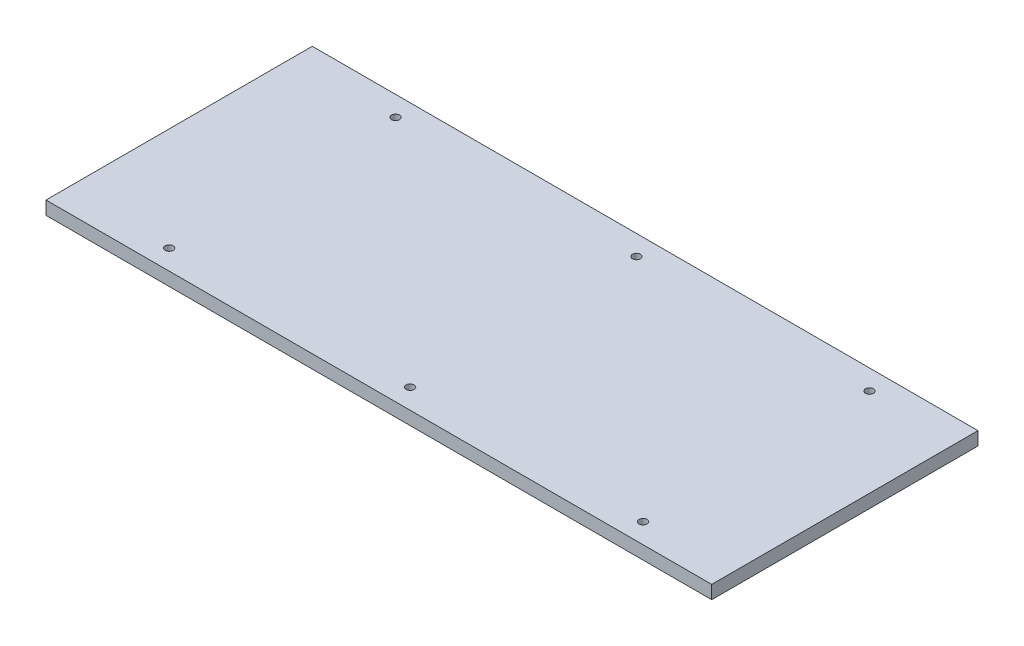
ISO-10303-21;
HEADER;
FILE_DESCRIPTION(('STEP AP214'),'2;1');
FILE_NAME('part.step','',(''),(''),'','','');
FILE_SCHEMA(('AUTOMOTIVE_DESIGN { 1 0 10303 214 1 1 1 1 }'));
ENDSEC;
DATA;
#1=APPLICATION_CONTEXT('core data for automotive mechanical design processes');
#2=APPLICATION_PROTOCOL_DEFINITION('international standard','automotive_design',2000,#1);
#3=PRODUCT_CONTEXT('',#1,'mechanical');
#4=PRODUCT('Part','Part','',(#3));
#5=PRODUCT_RELATED_PRODUCT_CATEGORY('part','',(#4));
#6=PRODUCT_DEFINITION_FORMATION('','',#4);
#7=PRODUCT_DEFINITION_CONTEXT('part definition',#1,'design');
#8=PRODUCT_DEFINITION('design','',#6,#7);
#9=PRODUCT_DEFINITION_SHAPE('','',#8);
#10=(LENGTH_UNIT() NAMED_UNIT(*) SI_UNIT(.MILLI.,.METRE.));
#11=(NAMED_UNIT(*) PLANE_ANGLE_UNIT() SI_UNIT($,.RADIAN.));
#12=(NAMED_UNIT(*) SI_UNIT($,.STERADIAN.) SOLID_ANGLE_UNIT());
#13=UNCERTAINTY_MEASURE_WITH_UNIT(LENGTH_MEASURE(1.E-05),#10,'distance_accuracy_value','');
#14=(GEOMETRIC_REPRESENTATION_CONTEXT(3) GLOBAL_UNCERTAINTY_ASSIGNED_CONTEXT((#13)) GLOBAL_UNIT_ASSIGNED_CONTEXT((#10,
#11,#12)) REPRESENTATION_CONTEXT('',''));
#15=CARTESIAN_POINT('',(0.,0.,0.));
#16=DIRECTION('',(0.,0.,1.));
#17=DIRECTION('',(1.,0.,0.));
#18=AXIS2_PLACEMENT_3D('',#15,#16,#17);
#19=CARTESIAN_POINT('',(0.,10.,0.));
#20=DIRECTION('',(0.,1.,0.));
#21=DIRECTION('',(0.,0.,1.));
#22=AXIS2_PLACEMENT_3D('',#19,#20,#21);
#23=PLANE('',#22);
#24=CARTESIAN_POINT('',(183.493329941735,10.,85.));
#25=DIRECTION('',(0.,1.,0.));
#26=DIRECTION('',(0.,0.,1.));
#27=AXIS2_PLACEMENT_3D('',#24,#25,#26);
#28=CIRCLE('',#27,2.99999999999999);
#29=CARTESIAN_POINT('',(183.493329941735,10.,88.));
#30=VERTEX_POINT('',#29);
#31=EDGE_CURVE('E158',#30,#30,#28,.T.);
#32=ORIENTED_EDGE('',*,*,#31,.F.);
#33=EDGE_LOOP('',(#32));
#34=FACE_BOUND('',#33,.T.);
#35=CARTESIAN_POINT('',(-172.506670058265,10.,-85.));
#36=DIRECTION('',(0.,1.,0.));
#37=DIRECTION('',(0.,0.,1.));
#38=AXIS2_PLACEMENT_3D('',#35,#36,#37);
#39=CIRCLE('',#38,2.99999999999999);
#40=CARTESIAN_POINT('',(-172.506670058265,10.,-82.));
#41=VERTEX_POINT('',#40);
#42=EDGE_CURVE('E142',#41,#41,#39,.T.);
#43=ORIENTED_EDGE('',*,*,#42,.F.);
#44=EDGE_LOOP('',(#43));
#45=FACE_BOUND('',#44,.T.);
#46=CARTESIAN_POINT('',(8.49332994173532,10.,-85.));
#47=DIRECTION('',(0.,1.,0.));
#48=DIRECTION('',(0.,0.,1.));
#49=AXIS2_PLACEMENT_3D('',#46,#47,#48);
#50=CIRCLE('',#49,3.);
#51=CARTESIAN_POINT('',(8.49332994173532,10.,-82.));
#52=VERTEX_POINT('',#51);
#53=EDGE_CURVE('E112',#52,#52,#50,.T.);
#54=ORIENTED_EDGE('',*,*,#53,.F.);
#55=EDGE_LOOP('',(#54));
#56=FACE_BOUND('',#55,.T.);
#57=DIRECTION('',(0.,0.,1.));
#58=VECTOR('',#57,1.);
#59=CARTESIAN_POINT('',(-250.,10.,100.));
#60=LINE('',#59,#58);
#61=CARTESIAN_POINT('',(-250.,10.,-100.));
#62=VERTEX_POINT('',#61);
#63=CARTESIAN_POINT('',(-250.,10.,100.));
#64=VERTEX_POINT('',#63);
#65=EDGE_CURVE('E92',#62,#64,#60,.T.);
#66=ORIENTED_EDGE('',*,*,#65,.T.);
#67=DIRECTION('',(1.,0.,0.));
#68=VECTOR('',#67,1.);
#69=CARTESIAN_POINT('',(250.,10.,100.));
#70=LINE('',#69,#68);
#71=CARTESIAN_POINT('',(250.,10.,100.));
#72=VERTEX_POINT('',#71);
#73=EDGE_CURVE('E87',#64,#72,#70,.T.);
#74=ORIENTED_EDGE('',*,*,#73,.T.);
#75=DIRECTION('',(0.,0.,-1.));
#76=VECTOR('',#75,1.);
#77=CARTESIAN_POINT('',(250.,10.,100.));
#78=LINE('',#77,#76);
#79=CARTESIAN_POINT('',(250.,10.,-100.));
#80=VERTEX_POINT('',#79);
#81=EDGE_CURVE('E90',#72,#80,#78,.T.);
#82=ORIENTED_EDGE('',*,*,#81,.T.);
#83=DIRECTION('',(-1.,0.,0.));
#84=VECTOR('',#83,1.);
#85=CARTESIAN_POINT('',(250.,10.,-100.));
#86=LINE('',#85,#84);
#87=EDGE_CURVE('E57',#80,#62,#86,.T.);
#88=ORIENTED_EDGE('',*,*,#87,.T.);
#89=EDGE_LOOP('',(#66,#74,#82,#88));
#90=FACE_BOUND('',#89,.T.);
#91=CARTESIAN_POINT('',(8.49332994173534,10.,85.));
#92=DIRECTION('',(0.,1.,0.));
#93=DIRECTION('',(0.,0.,1.));
#94=AXIS2_PLACEMENT_3D('',#91,#92,#93);
#95=CIRCLE('',#94,3.);
#96=CARTESIAN_POINT('',(8.49332994173534,10.,88.));
#97=VERTEX_POINT('',#96);
#98=EDGE_CURVE('E134',#97,#97,#95,.T.);
#99=ORIENTED_EDGE('',*,*,#98,.F.);
#100=EDGE_LOOP('',(#99));
#101=FACE_BOUND('',#100,.T.);
#102=CARTESIAN_POINT('',(-172.506670058265,10.,85.));
#103=DIRECTION('',(0.,1.,0.));
#104=DIRECTION('',(0.,0.,1.));
#105=AXIS2_PLACEMENT_3D('',#102,#103,#104);
#106=CIRCLE('',#105,2.99999999999999);
#107=CARTESIAN_POINT('',(-172.506670058265,10.,88.));
#108=VERTEX_POINT('',#107);
#109=EDGE_CURVE('E150',#108,#108,#106,.T.);
#110=ORIENTED_EDGE('',*,*,#109,.F.);
#111=EDGE_LOOP('',(#110));
#112=FACE_BOUND('',#111,.T.);
#113=CARTESIAN_POINT('',(183.493329941735,10.,-85.));
#114=DIRECTION('',(0.,1.,0.));
#115=DIRECTION('',(0.,0.,1.));
#116=AXIS2_PLACEMENT_3D('',#113,#114,#115);
#117=CIRCLE('',#116,2.99999999999999);
#118=CARTESIAN_POINT('',(183.493329941735,10.,-82.));
#119=VERTEX_POINT('',#118);
#120=EDGE_CURVE('E166',#119,#119,#117,.T.);
#121=ORIENTED_EDGE('',*,*,#120,.F.);
#122=EDGE_LOOP('',(#121));
#123=FACE_BOUND('',#122,.T.);
#124=ADVANCED_FACE('F39',(#34,#45,#56,#90,#101,#112,#123),#23,.T.);
#125=CARTESIAN_POINT('',(0.,0.,0.));
#126=DIRECTION('',(0.,1.,0.));
#127=DIRECTION('',(0.,0.,1.));
#128=AXIS2_PLACEMENT_3D('',#125,#126,#127);
#129=PLANE('',#128);
#130=DIRECTION('',(0.,0.,1.));
#131=VECTOR('',#130,1.);
#132=CARTESIAN_POINT('',(-250.,0.,100.));
#133=LINE('',#132,#131);
#134=CARTESIAN_POINT('',(-250.,0.,-100.));
#135=VERTEX_POINT('',#134);
#136=CARTESIAN_POINT('',(-250.,0.,100.));
#137=VERTEX_POINT('',#136);
#138=EDGE_CURVE('E108',#135,#137,#133,.T.);
#139=ORIENTED_EDGE('',*,*,#138,.F.);
#140=DIRECTION('',(-1.,0.,0.));
#141=VECTOR('',#140,1.);
#142=CARTESIAN_POINT('',(250.,0.,-100.));
#143=LINE('',#142,#141);
#144=CARTESIAN_POINT('',(250.,0.,-100.));
#145=VERTEX_POINT('',#144);
#146=EDGE_CURVE('E80',#145,#135,#143,.T.);
#147=ORIENTED_EDGE('',*,*,#146,.F.);
#148=DIRECTION('',(0.,0.,-1.));
#149=VECTOR('',#148,1.);
#150=CARTESIAN_POINT('',(250.,0.,100.));
#151=LINE('',#150,#149);
#152=CARTESIAN_POINT('',(250.,0.,100.));
#153=VERTEX_POINT('',#152);
#154=EDGE_CURVE('E74',#153,#145,#151,.T.);
#155=ORIENTED_EDGE('',*,*,#154,.F.);
#156=DIRECTION('',(1.,0.,0.));
#157=VECTOR('',#156,1.);
#158=CARTESIAN_POINT('',(250.,0.,100.));
#159=LINE('',#158,#157);
#160=EDGE_CURVE('E97',#137,#153,#159,.T.);
#161=ORIENTED_EDGE('',*,*,#160,.F.);
#162=EDGE_LOOP('',(#139,#147,#155,#161));
#163=FACE_BOUND('',#162,.T.);
#164=CARTESIAN_POINT('',(8.49332994173532,0.,-85.));
#165=DIRECTION('',(0.,1.,0.));
#166=DIRECTION('',(0.,0.,1.));
#167=AXIS2_PLACEMENT_3D('',#164,#165,#166);
#168=CIRCLE('',#167,3.);
#169=CARTESIAN_POINT('',(8.49332994173532,0.,-82.));
#170=VERTEX_POINT('',#169);
#171=EDGE_CURVE('E130',#170,#170,#168,.T.);
#172=ORIENTED_EDGE('',*,*,#171,.T.);
#173=EDGE_LOOP('',(#172));
#174=FACE_BOUND('',#173,.T.);
#175=CARTESIAN_POINT('',(8.49332994173534,0.,85.));
#176=DIRECTION('',(0.,1.,0.));
#177=DIRECTION('',(0.,0.,1.));
#178=AXIS2_PLACEMENT_3D('',#175,#176,#177);
#179=CIRCLE('',#178,3.);
#180=CARTESIAN_POINT('',(8.49332994173534,0.,88.));
#181=VERTEX_POINT('',#180);
#182=EDGE_CURVE('E138',#181,#181,#179,.T.);
#183=ORIENTED_EDGE('',*,*,#182,.T.);
#184=EDGE_LOOP('',(#183));
#185=FACE_BOUND('',#184,.T.);
#186=CARTESIAN_POINT('',(-172.506670058265,0.,-85.));
#187=DIRECTION('',(0.,1.,0.));
#188=DIRECTION('',(0.,0.,1.));
#189=AXIS2_PLACEMENT_3D('',#186,#187,#188);
#190=CIRCLE('',#189,2.99999999999999);
#191=CARTESIAN_POINT('',(-172.506670058265,0.,-82.));
#192=VERTEX_POINT('',#191);
#193=EDGE_CURVE('E146',#192,#192,#190,.T.);
#194=ORIENTED_EDGE('',*,*,#193,.T.);
#195=EDGE_LOOP('',(#194));
#196=FACE_BOUND('',#195,.T.);
#197=CARTESIAN_POINT('',(-172.506670058265,0.,85.));
#198=DIRECTION('',(0.,1.,0.));
#199=DIRECTION('',(0.,0.,1.));
#200=AXIS2_PLACEMENT_3D('',#197,#198,#199);
#201=CIRCLE('',#200,2.99999999999999);
#202=CARTESIAN_POINT('',(-172.506670058265,0.,88.));
#203=VERTEX_POINT('',#202);
#204=EDGE_CURVE('E154',#203,#203,#201,.T.);
#205=ORIENTED_EDGE('',*,*,#204,.T.);
#206=EDGE_LOOP('',(#205));
#207=FACE_BOUND('',#206,.T.);
#208=CARTESIAN_POINT('',(183.493329941735,0.,85.));
#209=DIRECTION('',(0.,1.,0.));
#210=DIRECTION('',(0.,0.,1.));
#211=AXIS2_PLACEMENT_3D('',#208,#209,#210);
#212=CIRCLE('',#211,2.99999999999999);
#213=CARTESIAN_POINT('',(183.493329941735,0.,88.));
#214=VERTEX_POINT('',#213);
#215=EDGE_CURVE('E162',#214,#214,#212,.T.);
#216=ORIENTED_EDGE('',*,*,#215,.T.);
#217=EDGE_LOOP('',(#216));
#218=FACE_BOUND('',#217,.T.);
#219=CARTESIAN_POINT('',(183.493329941735,0.,-85.));
#220=DIRECTION('',(0.,1.,0.));
#221=DIRECTION('',(0.,0.,1.));
#222=AXIS2_PLACEMENT_3D('',#219,#220,#221);
#223=CIRCLE('',#222,2.99999999999999);
#224=CARTESIAN_POINT('',(183.493329941735,0.,-82.));
#225=VERTEX_POINT('',#224);
#226=EDGE_CURVE('E170',#225,#225,#223,.T.);
#227=ORIENTED_EDGE('',*,*,#226,.T.);
#228=EDGE_LOOP('',(#227));
#229=FACE_BOUND('',#228,.T.);
#230=ADVANCED_FACE('F125',(#163,#174,#185,#196,#207,#218,#229),#129,.F.);
#231=CARTESIAN_POINT('',(-250.,10.,100.));
#232=DIRECTION('',(1.,0.,0.));
#233=DIRECTION('',(0.,0.,-1.));
#234=AXIS2_PLACEMENT_3D('',#231,#232,#233);
#235=PLANE('',#234);
#236=ORIENTED_EDGE('',*,*,#138,.T.);
#237=DIRECTION('',(0.,-1.,0.));
#238=VECTOR('',#237,1.);
#239=CARTESIAN_POINT('',(-250.,10.,100.));
#240=LINE('',#239,#238);
#241=EDGE_CURVE('E11',#64,#137,#240,.T.);
#242=ORIENTED_EDGE('',*,*,#241,.F.);
#243=ORIENTED_EDGE('',*,*,#65,.F.);
#244=DIRECTION('',(0.,-1.,0.));
#245=VECTOR('',#244,1.);
#246=CARTESIAN_POINT('',(-250.,10.,-100.));
#247=LINE('',#246,#245);
#248=EDGE_CURVE('E104',#62,#135,#247,.T.);
#249=ORIENTED_EDGE('',*,*,#248,.T.);
#250=EDGE_LOOP('',(#236,#242,#243,#249));
#251=FACE_BOUND('',#250,.T.);
#252=ADVANCED_FACE('F41',(#251),#235,.F.);
#253=CARTESIAN_POINT('',(250.,10.,100.));
#254=DIRECTION('',(0.,0.,-1.));
#255=DIRECTION('',(-1.,0.,0.));
#256=AXIS2_PLACEMENT_3D('',#253,#254,#255);
#257=PLANE('',#256);
#258=ORIENTED_EDGE('',*,*,#160,.T.);
#259=DIRECTION('',(0.,-1.,0.));
#260=VECTOR('',#259,1.);
#261=CARTESIAN_POINT('',(250.,10.,100.));
#262=LINE('',#261,#260);
#263=EDGE_CURVE('E49',#72,#153,#262,.T.);
#264=ORIENTED_EDGE('',*,*,#263,.F.);
#265=ORIENTED_EDGE('',*,*,#73,.F.);
#266=ORIENTED_EDGE('',*,*,#241,.T.);
#267=EDGE_LOOP('',(#258,#264,#265,#266));
#268=FACE_BOUND('',#267,.T.);
#269=ADVANCED_FACE('F96',(#268),#257,.F.);
#270=CARTESIAN_POINT('',(250.,10.,100.));
#271=DIRECTION('',(-1.,0.,0.));
#272=DIRECTION('',(0.,0.,1.));
#273=AXIS2_PLACEMENT_3D('',#270,#271,#272);
#274=PLANE('',#273);
#275=ORIENTED_EDGE('',*,*,#154,.T.);
#276=DIRECTION('',(0.,-1.,0.));
#277=VECTOR('',#276,1.);
#278=CARTESIAN_POINT('',(250.,10.,-100.));
#279=LINE('',#278,#277);
#280=EDGE_CURVE('E99',#80,#145,#279,.T.);
#281=ORIENTED_EDGE('',*,*,#280,.F.);
#282=ORIENTED_EDGE('',*,*,#81,.F.);
#283=ORIENTED_EDGE('',*,*,#263,.T.);
#284=EDGE_LOOP('',(#275,#281,#282,#283));
#285=FACE_BOUND('',#284,.T.);
#286=ADVANCED_FACE('F100',(#285),#274,.F.);
#287=CARTESIAN_POINT('',(250.,10.,-100.));
#288=DIRECTION('',(0.,0.,1.));
#289=DIRECTION('',(1.,0.,0.));
#290=AXIS2_PLACEMENT_3D('',#287,#288,#289);
#291=PLANE('',#290);
#292=ORIENTED_EDGE('',*,*,#146,.T.);
#293=ORIENTED_EDGE('',*,*,#248,.F.);
#294=ORIENTED_EDGE('',*,*,#87,.F.);
#295=ORIENTED_EDGE('',*,*,#280,.T.);
#296=EDGE_LOOP('',(#292,#293,#294,#295));
#297=FACE_BOUND('',#296,.T.);
#298=ADVANCED_FACE('F122',(#297),#291,.F.);
#299=CARTESIAN_POINT('',(8.49332994173532,10.,-85.));
#300=DIRECTION('',(0.,-1.,0.));
#301=DIRECTION('',(0.,0.,-1.));
#302=AXIS2_PLACEMENT_3D('',#299,#300,#301);
#303=CYLINDRICAL_SURFACE('',#302,3.);
#304=ORIENTED_EDGE('',*,*,#53,.T.);
#305=EDGE_LOOP('',(#304));
#306=FACE_BOUND('',#305,.T.);
#307=ORIENTED_EDGE('',*,*,#171,.F.);
#308=EDGE_LOOP('',(#307));
#309=FACE_BOUND('',#308,.T.);
#310=ADVANCED_FACE('F191',(#306,#309),#303,.F.);
#311=CARTESIAN_POINT('',(8.49332994173534,10.,85.));
#312=DIRECTION('',(0.,-1.,0.));
#313=DIRECTION('',(0.,0.,-1.));
#314=AXIS2_PLACEMENT_3D('',#311,#312,#313);
#315=CYLINDRICAL_SURFACE('',#314,3.);
#316=ORIENTED_EDGE('',*,*,#98,.T.);
#317=EDGE_LOOP('',(#316));
#318=FACE_BOUND('',#317,.T.);
#319=ORIENTED_EDGE('',*,*,#182,.F.);
#320=EDGE_LOOP('',(#319));
#321=FACE_BOUND('',#320,.T.);
#322=ADVANCED_FACE('F237',(#318,#321),#315,.F.);
#323=CARTESIAN_POINT('',(-172.506670058265,10.,-85.));
#324=DIRECTION('',(0.,-1.,0.));
#325=DIRECTION('',(0.,0.,-1.));
#326=AXIS2_PLACEMENT_3D('',#323,#324,#325);
#327=CYLINDRICAL_SURFACE('',#326,2.99999999999999);
#328=ORIENTED_EDGE('',*,*,#42,.T.);
#329=EDGE_LOOP('',(#328));
#330=FACE_BOUND('',#329,.T.);
#331=ORIENTED_EDGE('',*,*,#193,.F.);
#332=EDGE_LOOP('',(#331));
#333=FACE_BOUND('',#332,.T.);
#334=ADVANCED_FACE('F245',(#330,#333),#327,.F.);
#335=CARTESIAN_POINT('',(-172.506670058265,10.,85.));
#336=DIRECTION('',(0.,-1.,0.));
#337=DIRECTION('',(0.,0.,-1.));
#338=AXIS2_PLACEMENT_3D('',#335,#336,#337);
#339=CYLINDRICAL_SURFACE('',#338,2.99999999999999);
#340=ORIENTED_EDGE('',*,*,#109,.T.);
#341=EDGE_LOOP('',(#340));
#342=FACE_BOUND('',#341,.T.);
#343=ORIENTED_EDGE('',*,*,#204,.F.);
#344=EDGE_LOOP('',(#343));
#345=FACE_BOUND('',#344,.T.);
#346=ADVANCED_FACE('F253',(#342,#345),#339,.F.);
#347=CARTESIAN_POINT('',(183.493329941735,10.,85.));
#348=DIRECTION('',(0.,-1.,0.));
#349=DIRECTION('',(0.,0.,-1.));
#350=AXIS2_PLACEMENT_3D('',#347,#348,#349);
#351=CYLINDRICAL_SURFACE('',#350,2.99999999999999);
#352=ORIENTED_EDGE('',*,*,#31,.T.);
#353=EDGE_LOOP('',(#352));
#354=FACE_BOUND('',#353,.T.);
#355=ORIENTED_EDGE('',*,*,#215,.F.);
#356=EDGE_LOOP('',(#355));
#357=FACE_BOUND('',#356,.T.);
#358=ADVANCED_FACE('F262',(#354,#357),#351,.F.);
#359=CARTESIAN_POINT('',(183.493329941735,10.,-85.));
#360=DIRECTION('',(0.,-1.,0.));
#361=DIRECTION('',(0.,0.,-1.));
#362=AXIS2_PLACEMENT_3D('',#359,#360,#361);
#363=CYLINDRICAL_SURFACE('',#362,2.99999999999999);
#364=ORIENTED_EDGE('',*,*,#120,.T.);
#365=EDGE_LOOP('',(#364));
#366=FACE_BOUND('',#365,.T.);
#367=ORIENTED_EDGE('',*,*,#226,.F.);
#368=EDGE_LOOP('',(#367));
#369=FACE_BOUND('',#368,.T.);
#370=ADVANCED_FACE('F178',(#366,#369),#363,.F.);
#371=CLOSED_SHELL('',(#124,#230,#252,#269,#286,#298,#310,#322,#334,#346,#358,#370));
#372=MANIFOLD_SOLID_BREP('B2',#371);
#373=ADVANCED_BREP_SHAPE_REPRESENTATION('',(#18,#372),#14);
#374=SHAPE_DEFINITION_REPRESENTATION(#9,#373);
ENDSEC;
END-ISO-10303-21;
